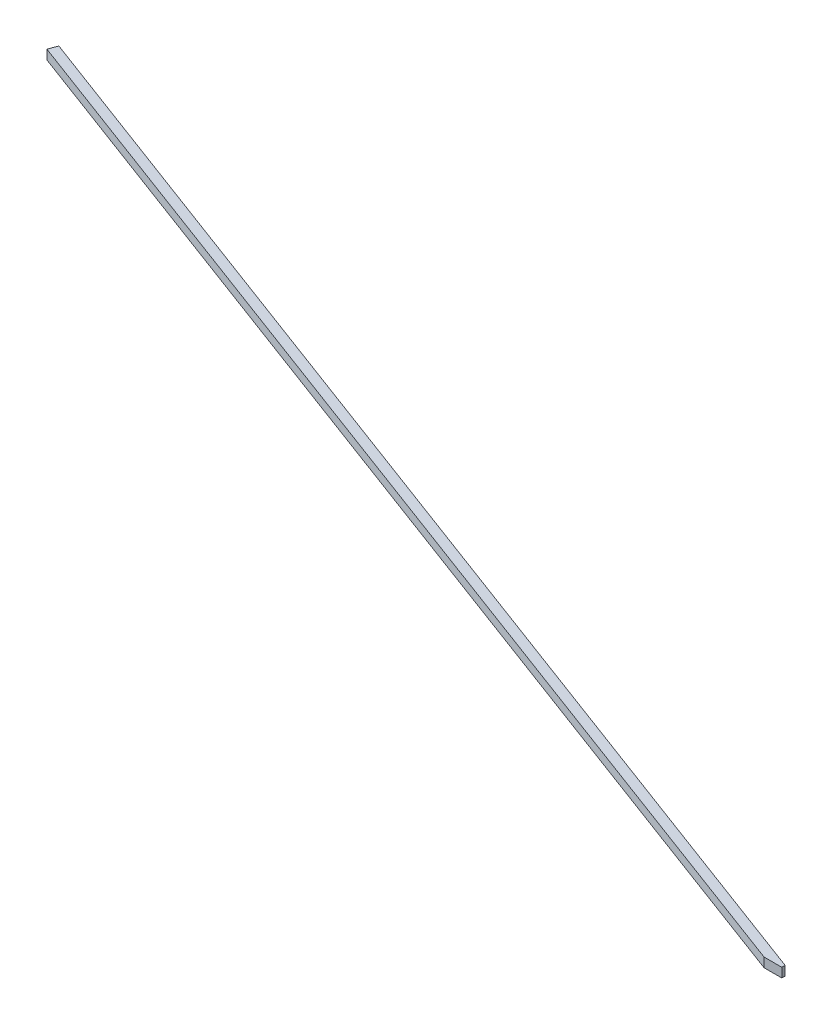
ISO-10303-21;
HEADER;
FILE_DESCRIPTION(('STEP AP214'),'2;1');
FILE_NAME('part.step','',(''),(''),'','','');
FILE_SCHEMA(('AUTOMOTIVE_DESIGN { 1 0 10303 214 1 1 1 1 }'));
ENDSEC;
DATA;
#1=APPLICATION_CONTEXT('core data for automotive mechanical design processes');
#2=APPLICATION_PROTOCOL_DEFINITION('international standard','automotive_design',2000,#1);
#3=PRODUCT_CONTEXT('',#1,'mechanical');
#4=PRODUCT('Part','Part','',(#3));
#5=PRODUCT_RELATED_PRODUCT_CATEGORY('part','',(#4));
#6=PRODUCT_DEFINITION_FORMATION('','',#4);
#7=PRODUCT_DEFINITION_CONTEXT('part definition',#1,'design');
#8=PRODUCT_DEFINITION('design','',#6,#7);
#9=PRODUCT_DEFINITION_SHAPE('','',#8);
#10=(LENGTH_UNIT() NAMED_UNIT(*) SI_UNIT(.MILLI.,.METRE.));
#11=(NAMED_UNIT(*) PLANE_ANGLE_UNIT() SI_UNIT($,.RADIAN.));
#12=(NAMED_UNIT(*) SI_UNIT($,.STERADIAN.) SOLID_ANGLE_UNIT());
#13=UNCERTAINTY_MEASURE_WITH_UNIT(LENGTH_MEASURE(1.E-05),#10,'distance_accuracy_value','');
#14=(GEOMETRIC_REPRESENTATION_CONTEXT(3) GLOBAL_UNCERTAINTY_ASSIGNED_CONTEXT((#13)) GLOBAL_UNIT_ASSIGNED_CONTEXT((#10,
#11,#12)) REPRESENTATION_CONTEXT('',''));
#15=CARTESIAN_POINT('',(0.,0.,0.));
#16=DIRECTION('',(0.,0.,1.));
#17=DIRECTION('',(1.,0.,0.));
#18=AXIS2_PLACEMENT_3D('',#15,#16,#17);
#19=CARTESIAN_POINT('',(-22.6651280605346,11.825,0.));
#20=DIRECTION('',(0.,-1.,0.));
#21=DIRECTION('',(0.,0.,-1.));
#22=AXIS2_PLACEMENT_3D('',#19,#20,#21);
#23=PLANE('',#22);
#24=DIRECTION('',(0.,0.,1.));
#25=VECTOR('',#24,1.);
#26=CARTESIAN_POINT('',(396.500306034483,11.825,0.));
#27=LINE('',#26,#25);
#28=CARTESIAN_POINT('',(396.500306034483,11.825,5.21578870259104));
#29=VERTEX_POINT('',#28);
#30=CARTESIAN_POINT('',(396.500306034483,11.825,6.35000000000001));
#31=VERTEX_POINT('',#30);
#32=EDGE_CURVE('E122',#29,#31,#27,.T.);
#33=ORIENTED_EDGE('',*,*,#32,.F.);
#34=DIRECTION('',(0.936777184767583,0.,0.349926429551873));
#35=VECTOR('',#34,1.);
#36=CARTESIAN_POINT('',(26.9513014702551,11.825,-132.826603676652));
#37=LINE('',#36,#35);
#38=CARTESIAN_POINT('',(1.43197308363951,11.825,-142.359166608473));
#39=VERTEX_POINT('',#38);
#40=EDGE_CURVE('E138',#39,#29,#37,.T.);
#41=ORIENTED_EDGE('',*,*,#40,.F.);
#42=DIRECTION('',(0.349926429551881,0.,-0.93677718476758));
#43=VECTOR('',#42,1.);
#44=CARTESIAN_POINT('',(0.320956669812314,11.825,-139.384899046836));
#45=LINE('',#44,#43);
#46=CARTESIAN_POINT('',(0.320956669812314,11.825,-139.384899046836));
#47=VERTEX_POINT('',#46);
#48=EDGE_CURVE('E147',#47,#39,#45,.T.);
#49=ORIENTED_EDGE('',*,*,#48,.F.);
#50=DIRECTION('',(0.936777184767583,0.,0.349926429551872));
#51=VECTOR('',#50,1.);
#52=CARTESIAN_POINT('',(25.8402850564278,11.825,-129.852336115014));
#53=LINE('',#52,#51);
#54=CARTESIAN_POINT('',(390.463332100885,11.825,6.35));
#55=VERTEX_POINT('',#54);
#56=EDGE_CURVE('E142',#47,#55,#53,.T.);
#57=ORIENTED_EDGE('',*,*,#56,.T.);
#58=DIRECTION('',(1.,0.,0.));
#59=VECTOR('',#58,1.);
#60=CARTESIAN_POINT('',(-22.6651280605346,11.825,6.35));
#61=LINE('',#60,#59);
#62=EDGE_CURVE('E136',#55,#31,#61,.T.);
#63=ORIENTED_EDGE('',*,*,#62,.T.);
#64=EDGE_LOOP('',(#33,#41,#49,#57,#63));
#65=FACE_BOUND('',#64,.T.);
#66=ADVANCED_FACE('F76',(#65),#23,.F.);
#67=CARTESIAN_POINT('',(-22.6651280605346,0.,6.35));
#68=DIRECTION('',(0.,0.,1.));
#69=DIRECTION('',(1.,0.,0.));
#70=AXIS2_PLACEMENT_3D('',#67,#68,#69);
#71=PLANE('',#70);
#72=DIRECTION('',(1.,0.,0.));
#73=VECTOR('',#72,1.);
#74=CARTESIAN_POINT('',(-22.6651280605346,8.65,6.35));
#75=LINE('',#74,#73);
#76=CARTESIAN_POINT('',(390.463332100885,8.65,6.35));
#77=VERTEX_POINT('',#76);
#78=CARTESIAN_POINT('',(396.500306034483,8.65,6.35000000000001));
#79=VERTEX_POINT('',#78);
#80=EDGE_CURVE('E83',#77,#79,#75,.T.);
#81=ORIENTED_EDGE('',*,*,#80,.T.);
#82=DIRECTION('',(0.,-1.,0.));
#83=VECTOR('',#82,1.);
#84=CARTESIAN_POINT('',(396.500306034483,18.65,6.35000000000001));
#85=LINE('',#84,#83);
#86=EDGE_CURVE('E119',#31,#79,#85,.T.);
#87=ORIENTED_EDGE('',*,*,#86,.F.);
#88=ORIENTED_EDGE('',*,*,#62,.F.);
#89=DIRECTION('',(0.,-1.,0.));
#90=VECTOR('',#89,1.);
#91=CARTESIAN_POINT('',(390.463332100885,51.35,6.35));
#92=LINE('',#91,#90);
#93=EDGE_CURVE('E97',#55,#77,#92,.T.);
#94=ORIENTED_EDGE('',*,*,#93,.T.);
#95=EDGE_LOOP('',(#81,#87,#88,#94));
#96=FACE_BOUND('',#95,.T.);
#97=ADVANCED_FACE('F135',(#96),#71,.T.);
#98=CARTESIAN_POINT('',(-22.6651280605346,8.65,0.));
#99=DIRECTION('',(0.,-1.,0.));
#100=DIRECTION('',(0.,0.,-1.));
#101=AXIS2_PLACEMENT_3D('',#98,#99,#100);
#102=PLANE('',#101);
#103=DIRECTION('',(0.936777184767583,0.,0.349926429551873));
#104=VECTOR('',#103,1.);
#105=CARTESIAN_POINT('',(46.8411184592365,8.65,-125.39690453734));
#106=LINE('',#105,#104);
#107=CARTESIAN_POINT('',(1.43197308363951,8.65,-142.359166608473));
#108=VERTEX_POINT('',#107);
#109=CARTESIAN_POINT('',(396.500306034483,8.65,5.2157887025911));
#110=VERTEX_POINT('',#109);
#111=EDGE_CURVE('E133',#108,#110,#106,.T.);
#112=ORIENTED_EDGE('',*,*,#111,.T.);
#113=DIRECTION('',(0.,0.,1.));
#114=VECTOR('',#113,1.);
#115=CARTESIAN_POINT('',(396.500306034483,8.65,5.21578870259104));
#116=LINE('',#115,#114);
#117=EDGE_CURVE('E90',#110,#79,#116,.T.);
#118=ORIENTED_EDGE('',*,*,#117,.T.);
#119=ORIENTED_EDGE('',*,*,#80,.F.);
#120=DIRECTION('',(0.936777184767583,0.,0.349926429551872));
#121=VECTOR('',#120,1.);
#122=CARTESIAN_POINT('',(45.7301020454092,8.65,-122.422636975703));
#123=LINE('',#122,#121);
#124=CARTESIAN_POINT('',(0.320956669812314,8.65,-139.384899046836));
#125=VERTEX_POINT('',#124);
#126=EDGE_CURVE('E145',#125,#77,#123,.T.);
#127=ORIENTED_EDGE('',*,*,#126,.F.);
#128=DIRECTION('',(-0.349926429551881,0.,0.93677718476758));
#129=VECTOR('',#128,1.);
#130=CARTESIAN_POINT('',(1.43197308363951,8.65,-142.359166608473));
#131=LINE('',#130,#129);
#132=EDGE_CURVE('E154',#108,#125,#131,.T.);
#133=ORIENTED_EDGE('',*,*,#132,.F.);
#134=EDGE_LOOP('',(#112,#118,#119,#127,#133));
#135=FACE_BOUND('',#134,.T.);
#136=ADVANCED_FACE('F131',(#135),#102,.T.);
#137=CARTESIAN_POINT('',(46.8411184592365,51.35,-125.39690453734));
#138=DIRECTION('',(0.349926429551873,0.,-0.936777184767583));
#139=DIRECTION('',(-0.936777184767583,0.,-0.349926429551873));
#140=AXIS2_PLACEMENT_3D('',#137,#138,#139);
#141=PLANE('',#140);
#142=ORIENTED_EDGE('',*,*,#40,.T.);
#143=DIRECTION('',(0.,-1.,0.));
#144=VECTOR('',#143,1.);
#145=CARTESIAN_POINT('',(396.500306034483,51.35,5.21578870259104));
#146=LINE('',#145,#144);
#147=EDGE_CURVE('E12',#29,#110,#146,.T.);
#148=ORIENTED_EDGE('',*,*,#147,.T.);
#149=ORIENTED_EDGE('',*,*,#111,.F.);
#150=DIRECTION('',(0.,-1.,0.));
#151=VECTOR('',#150,1.);
#152=CARTESIAN_POINT('',(1.43197308363951,11.825,-142.359166608473));
#153=LINE('',#152,#151);
#154=EDGE_CURVE('E157',#39,#108,#153,.T.);
#155=ORIENTED_EDGE('',*,*,#154,.F.);
#156=EDGE_LOOP('',(#142,#148,#149,#155));
#157=FACE_BOUND('',#156,.T.);
#158=ADVANCED_FACE('F166',(#157),#141,.T.);
#159=CARTESIAN_POINT('',(45.7301020454092,51.35,-122.422636975703));
#160=DIRECTION('',(0.349926429551872,0.,-0.936777184767583));
#161=DIRECTION('',(-0.936777184767583,0.,-0.349926429551872));
#162=AXIS2_PLACEMENT_3D('',#159,#160,#161);
#163=PLANE('',#162);
#164=ORIENTED_EDGE('',*,*,#56,.F.);
#165=DIRECTION('',(0.,1.,0.));
#166=VECTOR('',#165,1.);
#167=CARTESIAN_POINT('',(0.320956669812314,8.65,-139.384899046836));
#168=LINE('',#167,#166);
#169=EDGE_CURVE('E151',#125,#47,#168,.T.);
#170=ORIENTED_EDGE('',*,*,#169,.F.);
#171=ORIENTED_EDGE('',*,*,#126,.T.);
#172=ORIENTED_EDGE('',*,*,#93,.F.);
#173=EDGE_LOOP('',(#164,#170,#171,#172));
#174=FACE_BOUND('',#173,.T.);
#175=ADVANCED_FACE('F167',(#174),#163,.F.);
#176=CARTESIAN_POINT('',(-45.4091453755984,0.,-16.9622620711326));
#177=DIRECTION('',(-0.93677718476758,0.,-0.349926429551881));
#178=DIRECTION('',(-0.349926429551881,0.,0.93677718476758));
#179=AXIS2_PLACEMENT_3D('',#176,#177,#178);
#180=PLANE('',#179);
#181=ORIENTED_EDGE('',*,*,#154,.T.);
#182=ORIENTED_EDGE('',*,*,#132,.T.);
#183=ORIENTED_EDGE('',*,*,#169,.T.);
#184=ORIENTED_EDGE('',*,*,#48,.T.);
#185=EDGE_LOOP('',(#181,#182,#183,#184));
#186=FACE_BOUND('',#185,.T.);
#187=ADVANCED_FACE('F162',(#186),#180,.T.);
#188=CARTESIAN_POINT('',(396.500306034483,18.65,5.21578870259104));
#189=DIRECTION('',(1.,0.,0.));
#190=DIRECTION('',(0.,0.,-1.));
#191=AXIS2_PLACEMENT_3D('',#188,#189,#190);
#192=PLANE('',#191);
#193=ORIENTED_EDGE('',*,*,#32,.T.);
#194=ORIENTED_EDGE('',*,*,#86,.T.);
#195=ORIENTED_EDGE('',*,*,#117,.F.);
#196=ORIENTED_EDGE('',*,*,#147,.F.);
#197=EDGE_LOOP('',(#193,#194,#195,#196));
#198=FACE_BOUND('',#197,.T.);
#199=ADVANCED_FACE('F120',(#198),#192,.T.);
#200=CLOSED_SHELL('',(#66,#97,#136,#158,#175,#187,#199));
#201=MANIFOLD_SOLID_BREP('B2',#200);
#202=ADVANCED_BREP_SHAPE_REPRESENTATION('',(#18,#201),#14);
#203=SHAPE_DEFINITION_REPRESENTATION(#9,#202);
ENDSEC;
END-ISO-10303-21;
